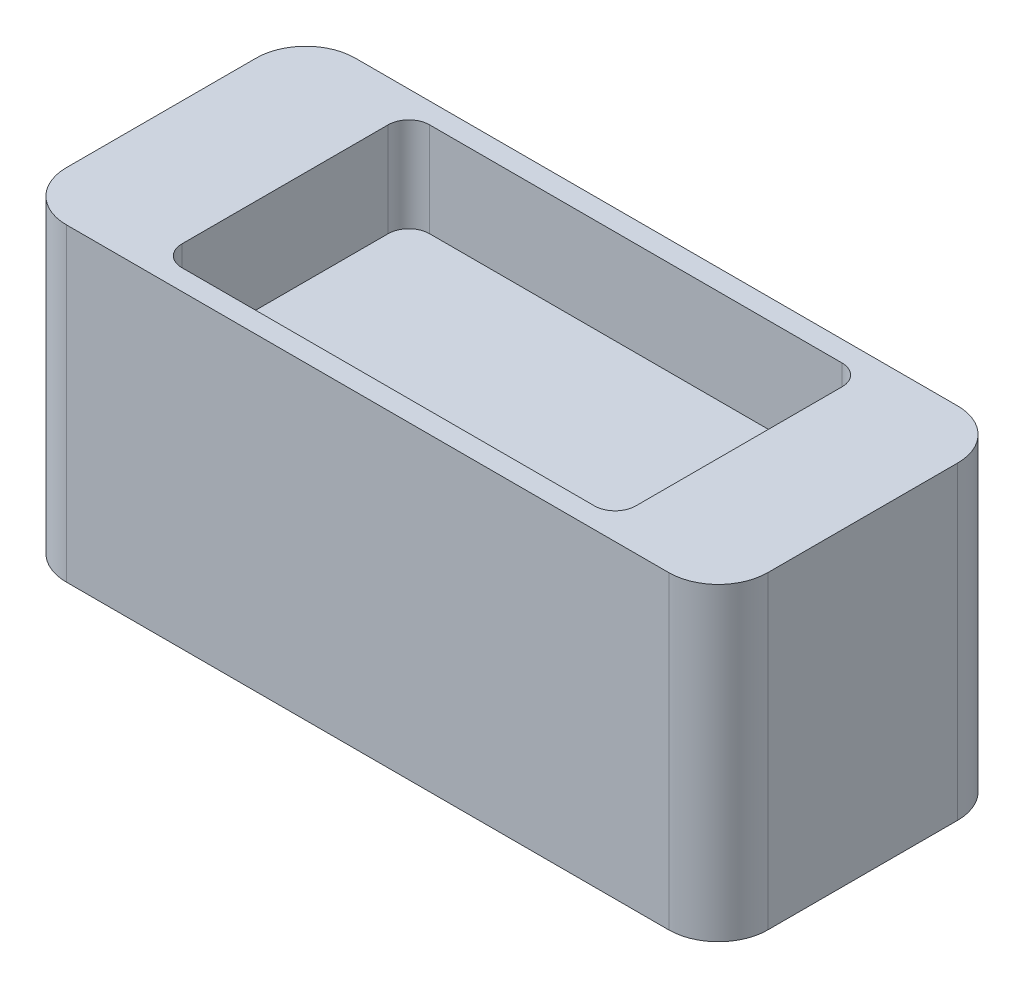
ISO-10303-21;
HEADER;
FILE_DESCRIPTION(('STEP AP214'),'2;1');
FILE_NAME('part.step','',(''),(''),'','','');
FILE_SCHEMA(('AUTOMOTIVE_DESIGN { 1 0 10303 214 1 1 1 1 }'));
ENDSEC;
DATA;
#1=APPLICATION_CONTEXT('core data for automotive mechanical design processes');
#2=APPLICATION_PROTOCOL_DEFINITION('international standard','automotive_design',2000,#1);
#3=PRODUCT_CONTEXT('',#1,'mechanical');
#4=PRODUCT('Part','Part','',(#3));
#5=PRODUCT_RELATED_PRODUCT_CATEGORY('part','',(#4));
#6=PRODUCT_DEFINITION_FORMATION('','',#4);
#7=PRODUCT_DEFINITION_CONTEXT('part definition',#1,'design');
#8=PRODUCT_DEFINITION('design','',#6,#7);
#9=PRODUCT_DEFINITION_SHAPE('','',#8);
#10=(LENGTH_UNIT() NAMED_UNIT(*) SI_UNIT(.MILLI.,.METRE.));
#11=(NAMED_UNIT(*) PLANE_ANGLE_UNIT() SI_UNIT($,.RADIAN.));
#12=(NAMED_UNIT(*) SI_UNIT($,.STERADIAN.) SOLID_ANGLE_UNIT());
#13=UNCERTAINTY_MEASURE_WITH_UNIT(LENGTH_MEASURE(1.E-05),#10,'distance_accuracy_value','');
#14=(GEOMETRIC_REPRESENTATION_CONTEXT(3) GLOBAL_UNCERTAINTY_ASSIGNED_CONTEXT((#13)) GLOBAL_UNIT_ASSIGNED_CONTEXT((#10,
#11,#12)) REPRESENTATION_CONTEXT('',''));
#15=CARTESIAN_POINT('',(0.,0.,0.));
#16=DIRECTION('',(0.,0.,1.));
#17=DIRECTION('',(1.,0.,0.));
#18=AXIS2_PLACEMENT_3D('',#15,#16,#17);
#19=CARTESIAN_POINT('',(0.,0.,0.));
#20=DIRECTION('',(0.,1.,0.));
#21=DIRECTION('',(0.,0.,1.));
#22=AXIS2_PLACEMENT_3D('',#19,#20,#21);
#23=PLANE('',#22);
#24=DIRECTION('',(1.,0.,0.));
#25=VECTOR('',#24,1.);
#26=CARTESIAN_POINT('',(0.,0.,-350.));
#27=LINE('',#26,#25);
#28=CARTESIAN_POINT('',(-730.,0.,-350.));
#29=VERTEX_POINT('',#28);
#30=CARTESIAN_POINT('',(730.,0.,-350.));
#31=VERTEX_POINT('',#30);
#32=EDGE_CURVE('E254',#29,#31,#27,.T.);
#33=ORIENTED_EDGE('',*,*,#32,.F.);
#34=CARTESIAN_POINT('',(-730.,0.,-230.));
#35=DIRECTION('',(0.,1.,0.));
#36=DIRECTION('',(0.,0.,1.));
#37=AXIS2_PLACEMENT_3D('',#34,#35,#36);
#38=CIRCLE('',#37,120.);
#39=CARTESIAN_POINT('',(-850.,0.,-230.));
#40=VERTEX_POINT('',#39);
#41=EDGE_CURVE('E208',#29,#40,#38,.T.);
#42=ORIENTED_EDGE('',*,*,#41,.T.);
#43=DIRECTION('',(0.,0.,1.));
#44=VECTOR('',#43,1.);
#45=CARTESIAN_POINT('',(-850.,0.,0.));
#46=LINE('',#45,#44);
#47=CARTESIAN_POINT('',(-850.,0.,230.));
#48=VERTEX_POINT('',#47);
#49=EDGE_CURVE('E260',#40,#48,#46,.T.);
#50=ORIENTED_EDGE('',*,*,#49,.T.);
#51=CARTESIAN_POINT('',(-730.,0.,230.));
#52=DIRECTION('',(0.,1.,0.));
#53=DIRECTION('',(0.,0.,1.));
#54=AXIS2_PLACEMENT_3D('',#51,#52,#53);
#55=CIRCLE('',#54,120.);
#56=CARTESIAN_POINT('',(-730.,0.,350.));
#57=VERTEX_POINT('',#56);
#58=EDGE_CURVE('E264',#48,#57,#55,.T.);
#59=ORIENTED_EDGE('',*,*,#58,.T.);
#60=DIRECTION('',(1.,0.,0.));
#61=VECTOR('',#60,1.);
#62=CARTESIAN_POINT('',(0.,0.,350.));
#63=LINE('',#62,#61);
#64=CARTESIAN_POINT('',(730.,0.,350.));
#65=VERTEX_POINT('',#64);
#66=EDGE_CURVE('E268',#57,#65,#63,.T.);
#67=ORIENTED_EDGE('',*,*,#66,.T.);
#68=CARTESIAN_POINT('',(730.,0.,230.));
#69=DIRECTION('',(0.,1.,0.));
#70=DIRECTION('',(0.,0.,1.));
#71=AXIS2_PLACEMENT_3D('',#68,#69,#70);
#72=CIRCLE('',#71,120.);
#73=CARTESIAN_POINT('',(850.,0.,230.));
#74=VERTEX_POINT('',#73);
#75=EDGE_CURVE('E272',#65,#74,#72,.T.);
#76=ORIENTED_EDGE('',*,*,#75,.T.);
#77=DIRECTION('',(0.,0.,1.));
#78=VECTOR('',#77,1.);
#79=CARTESIAN_POINT('',(850.,0.,0.));
#80=LINE('',#79,#78);
#81=CARTESIAN_POINT('',(850.,0.,-230.));
#82=VERTEX_POINT('',#81);
#83=EDGE_CURVE('E276',#82,#74,#80,.T.);
#84=ORIENTED_EDGE('',*,*,#83,.F.);
#85=CARTESIAN_POINT('',(730.,0.,-230.));
#86=DIRECTION('',(0.,1.,0.));
#87=DIRECTION('',(0.,0.,1.));
#88=AXIS2_PLACEMENT_3D('',#85,#86,#87);
#89=CIRCLE('',#88,120.);
#90=EDGE_CURVE('E224',#31,#82,#89,.F.);
#91=ORIENTED_EDGE('',*,*,#90,.F.);
#92=EDGE_LOOP('',(#33,#42,#50,#59,#67,#76,#84,#91));
#93=FACE_BOUND('',#92,.T.);
#94=DIRECTION('',(0.,0.,1.));
#95=VECTOR('',#94,1.);
#96=CARTESIAN_POINT('',(-550.,0.,1.01770443923973E-13));
#97=LINE('',#96,#95);
#98=CARTESIAN_POINT('',(-550.,0.,-249.999999924));
#99=VERTEX_POINT('',#98);
#100=CARTESIAN_POINT('',(-550.,0.,249.999999924));
#101=VERTEX_POINT('',#100);
#102=EDGE_CURVE('E385',#99,#101,#97,.T.);
#103=ORIENTED_EDGE('',*,*,#102,.F.);
#104=CARTESIAN_POINT('',(-499.999999924,0.,-249.999999924));
#105=DIRECTION('',(0.,1.,0.));
#106=DIRECTION('',(0.,0.,1.));
#107=AXIS2_PLACEMENT_3D('',#104,#105,#106);
#108=CIRCLE('',#107,50.000000076);
#109=CARTESIAN_POINT('',(-499.999999924,0.,-300.));
#110=VERTEX_POINT('',#109);
#111=EDGE_CURVE('E12',#99,#110,#108,.F.);
#112=ORIENTED_EDGE('',*,*,#111,.T.);
#113=DIRECTION('',(1.,0.,0.));
#114=VECTOR('',#113,1.);
#115=CARTESIAN_POINT('',(0.,0.,-300.));
#116=LINE('',#115,#114);
#117=CARTESIAN_POINT('',(499.999999924,0.,-300.));
#118=VERTEX_POINT('',#117);
#119=EDGE_CURVE('E350',#110,#118,#116,.T.);
#120=ORIENTED_EDGE('',*,*,#119,.T.);
#121=CARTESIAN_POINT('',(499.999999924,0.,-249.999999924));
#122=DIRECTION('',(0.,1.,0.));
#123=DIRECTION('',(0.,0.,1.));
#124=AXIS2_PLACEMENT_3D('',#121,#122,#123);
#125=CIRCLE('',#124,50.000000076);
#126=CARTESIAN_POINT('',(550.,0.,-249.999999924));
#127=VERTEX_POINT('',#126);
#128=EDGE_CURVE('E98',#118,#127,#125,.F.);
#129=ORIENTED_EDGE('',*,*,#128,.T.);
#130=DIRECTION('',(0.,0.,1.));
#131=VECTOR('',#130,1.);
#132=CARTESIAN_POINT('',(550.,0.,-1.01770443923973E-13));
#133=LINE('',#132,#131);
#134=CARTESIAN_POINT('',(550.,0.,249.999999924));
#135=VERTEX_POINT('',#134);
#136=EDGE_CURVE('E349',#127,#135,#133,.T.);
#137=ORIENTED_EDGE('',*,*,#136,.T.);
#138=CARTESIAN_POINT('',(499.999999924,0.,249.999999924));
#139=DIRECTION('',(0.,1.,0.));
#140=DIRECTION('',(0.,0.,1.));
#141=AXIS2_PLACEMENT_3D('',#138,#139,#140);
#142=CIRCLE('',#141,50.000000076);
#143=CARTESIAN_POINT('',(499.999999924,0.,300.));
#144=VERTEX_POINT('',#143);
#145=EDGE_CURVE('E341',#135,#144,#142,.F.);
#146=ORIENTED_EDGE('',*,*,#145,.T.);
#147=DIRECTION('',(1.,0.,0.));
#148=VECTOR('',#147,1.);
#149=CARTESIAN_POINT('',(0.,0.,300.));
#150=LINE('',#149,#148);
#151=CARTESIAN_POINT('',(-499.999999924,0.,300.));
#152=VERTEX_POINT('',#151);
#153=EDGE_CURVE('E378',#152,#144,#150,.T.);
#154=ORIENTED_EDGE('',*,*,#153,.F.);
#155=CARTESIAN_POINT('',(-499.999999924,0.,249.999999924));
#156=DIRECTION('',(0.,1.,0.));
#157=DIRECTION('',(0.,0.,1.));
#158=AXIS2_PLACEMENT_3D('',#155,#156,#157);
#159=CIRCLE('',#158,50.000000076);
#160=EDGE_CURVE('E344',#152,#101,#159,.F.);
#161=ORIENTED_EDGE('',*,*,#160,.T.);
#162=EDGE_LOOP('',(#103,#112,#120,#129,#137,#146,#154,#161));
#163=FACE_BOUND('',#162,.T.);
#164=ADVANCED_FACE('F89',(#93,#163),#23,.T.);
#165=CARTESIAN_POINT('',(-730.,-750.,230.));
#166=DIRECTION('',(0.,1.,0.));
#167=DIRECTION('',(0.,0.,1.));
#168=AXIS2_PLACEMENT_3D('',#165,#166,#167);
#169=CYLINDRICAL_SURFACE('',#168,120.);
#170=ORIENTED_EDGE('',*,*,#58,.F.);
#171=DIRECTION('',(0.,1.,0.));
#172=VECTOR('',#171,1.);
#173=CARTESIAN_POINT('',(-850.,-750.,230.));
#174=LINE('',#173,#172);
#175=CARTESIAN_POINT('',(-850.,-750.,230.));
#176=VERTEX_POINT('',#175);
#177=EDGE_CURVE('E298',#176,#48,#174,.T.);
#178=ORIENTED_EDGE('',*,*,#177,.F.);
#179=CARTESIAN_POINT('',(-730.,-750.,230.));
#180=DIRECTION('',(0.,1.,0.));
#181=DIRECTION('',(0.,0.,1.));
#182=AXIS2_PLACEMENT_3D('',#179,#180,#181);
#183=CIRCLE('',#182,120.);
#184=CARTESIAN_POINT('',(-730.,-750.,350.));
#185=VERTEX_POINT('',#184);
#186=EDGE_CURVE('E234',#176,#185,#183,.T.);
#187=ORIENTED_EDGE('',*,*,#186,.T.);
#188=DIRECTION('',(0.,1.,0.));
#189=VECTOR('',#188,1.);
#190=CARTESIAN_POINT('',(-730.,-750.,350.));
#191=LINE('',#190,#189);
#192=EDGE_CURVE('E295',#185,#57,#191,.T.);
#193=ORIENTED_EDGE('',*,*,#192,.T.);
#194=EDGE_LOOP('',(#170,#178,#187,#193));
#195=FACE_BOUND('',#194,.T.);
#196=ADVANCED_FACE('F413',(#195),#169,.T.);
#197=CARTESIAN_POINT('',(0.,-750.,350.));
#198=DIRECTION('',(0.,0.,1.));
#199=DIRECTION('',(1.,0.,0.));
#200=AXIS2_PLACEMENT_3D('',#197,#198,#199);
#201=PLANE('',#200);
#202=ORIENTED_EDGE('',*,*,#66,.F.);
#203=ORIENTED_EDGE('',*,*,#192,.F.);
#204=DIRECTION('',(1.,0.,0.));
#205=VECTOR('',#204,1.);
#206=CARTESIAN_POINT('',(0.,-750.,350.));
#207=LINE('',#206,#205);
#208=CARTESIAN_POINT('',(730.,-750.,350.));
#209=VERTEX_POINT('',#208);
#210=EDGE_CURVE('E241',#185,#209,#207,.T.);
#211=ORIENTED_EDGE('',*,*,#210,.T.);
#212=DIRECTION('',(0.,1.,0.));
#213=VECTOR('',#212,1.);
#214=CARTESIAN_POINT('',(730.,-750.,350.));
#215=LINE('',#214,#213);
#216=EDGE_CURVE('E292',#209,#65,#215,.T.);
#217=ORIENTED_EDGE('',*,*,#216,.T.);
#218=EDGE_LOOP('',(#202,#203,#211,#217));
#219=FACE_BOUND('',#218,.T.);
#220=ADVANCED_FACE('F419',(#219),#201,.T.);
#221=CARTESIAN_POINT('',(730.,-750.,230.));
#222=DIRECTION('',(0.,1.,0.));
#223=DIRECTION('',(0.,0.,1.));
#224=AXIS2_PLACEMENT_3D('',#221,#222,#223);
#225=CYLINDRICAL_SURFACE('',#224,120.);
#226=ORIENTED_EDGE('',*,*,#75,.F.);
#227=ORIENTED_EDGE('',*,*,#216,.F.);
#228=CARTESIAN_POINT('',(730.,-750.,230.));
#229=DIRECTION('',(0.,1.,0.));
#230=DIRECTION('',(0.,0.,1.));
#231=AXIS2_PLACEMENT_3D('',#228,#229,#230);
#232=CIRCLE('',#231,120.);
#233=CARTESIAN_POINT('',(850.,-750.,230.));
#234=VERTEX_POINT('',#233);
#235=EDGE_CURVE('E245',#209,#234,#232,.T.);
#236=ORIENTED_EDGE('',*,*,#235,.T.);
#237=DIRECTION('',(0.,1.,0.));
#238=VECTOR('',#237,1.);
#239=CARTESIAN_POINT('',(850.,-750.,230.));
#240=LINE('',#239,#238);
#241=EDGE_CURVE('E289',#234,#74,#240,.T.);
#242=ORIENTED_EDGE('',*,*,#241,.T.);
#243=EDGE_LOOP('',(#226,#227,#236,#242));
#244=FACE_BOUND('',#243,.T.);
#245=ADVANCED_FACE('F432',(#244),#225,.T.);
#246=CARTESIAN_POINT('',(850.,-750.,0.));
#247=DIRECTION('',(-1.,0.,0.));
#248=DIRECTION('',(0.,0.,1.));
#249=AXIS2_PLACEMENT_3D('',#246,#247,#248);
#250=PLANE('',#249);
#251=ORIENTED_EDGE('',*,*,#83,.T.);
#252=ORIENTED_EDGE('',*,*,#241,.F.);
#253=DIRECTION('',(0.,0.,1.));
#254=VECTOR('',#253,1.);
#255=CARTESIAN_POINT('',(850.,-750.,0.));
#256=LINE('',#255,#254);
#257=CARTESIAN_POINT('',(850.,-750.,-230.));
#258=VERTEX_POINT('',#257);
#259=EDGE_CURVE('E249',#258,#234,#256,.T.);
#260=ORIENTED_EDGE('',*,*,#259,.F.);
#261=DIRECTION('',(0.,1.,0.));
#262=VECTOR('',#261,1.);
#263=CARTESIAN_POINT('',(850.,-750.,-230.));
#264=LINE('',#263,#262);
#265=EDGE_CURVE('E285',#258,#82,#264,.T.);
#266=ORIENTED_EDGE('',*,*,#265,.T.);
#267=EDGE_LOOP('',(#251,#252,#260,#266));
#268=FACE_BOUND('',#267,.T.);
#269=ADVANCED_FACE('F428',(#268),#250,.F.);
#270=CARTESIAN_POINT('',(730.,-750.,-230.));
#271=DIRECTION('',(0.,1.,0.));
#272=DIRECTION('',(0.,0.,1.));
#273=AXIS2_PLACEMENT_3D('',#270,#271,#272);
#274=CYLINDRICAL_SURFACE('',#273,120.);
#275=ORIENTED_EDGE('',*,*,#90,.T.);
#276=ORIENTED_EDGE('',*,*,#265,.F.);
#277=CARTESIAN_POINT('',(730.,-750.,-230.));
#278=DIRECTION('',(0.,1.,0.));
#279=DIRECTION('',(0.,0.,1.));
#280=AXIS2_PLACEMENT_3D('',#277,#278,#279);
#281=CIRCLE('',#280,120.);
#282=CARTESIAN_POINT('',(730.,-750.,-350.));
#283=VERTEX_POINT('',#282);
#284=EDGE_CURVE('E214',#283,#258,#281,.F.);
#285=ORIENTED_EDGE('',*,*,#284,.F.);
#286=DIRECTION('',(0.,1.,0.));
#287=VECTOR('',#286,1.);
#288=CARTESIAN_POINT('',(730.,-750.,-350.));
#289=LINE('',#288,#287);
#290=EDGE_CURVE('E221',#283,#31,#289,.T.);
#291=ORIENTED_EDGE('',*,*,#290,.T.);
#292=EDGE_LOOP('',(#275,#276,#285,#291));
#293=FACE_BOUND('',#292,.T.);
#294=ADVANCED_FACE('F425',(#293),#274,.T.);
#295=CARTESIAN_POINT('',(0.,-750.,-350.));
#296=DIRECTION('',(0.,0.,1.));
#297=DIRECTION('',(1.,0.,0.));
#298=AXIS2_PLACEMENT_3D('',#295,#296,#297);
#299=PLANE('',#298);
#300=ORIENTED_EDGE('',*,*,#32,.T.);
#301=ORIENTED_EDGE('',*,*,#290,.F.);
#302=DIRECTION('',(1.,0.,0.));
#303=VECTOR('',#302,1.);
#304=CARTESIAN_POINT('',(0.,-750.,-350.));
#305=LINE('',#304,#303);
#306=CARTESIAN_POINT('',(-730.,-750.,-350.));
#307=VERTEX_POINT('',#306);
#308=EDGE_CURVE('E218',#307,#283,#305,.T.);
#309=ORIENTED_EDGE('',*,*,#308,.F.);
#310=DIRECTION('',(0.,1.,0.));
#311=VECTOR('',#310,1.);
#312=CARTESIAN_POINT('',(-730.,-750.,-350.));
#313=LINE('',#312,#311);
#314=EDGE_CURVE('E202',#307,#29,#313,.T.);
#315=ORIENTED_EDGE('',*,*,#314,.T.);
#316=EDGE_LOOP('',(#300,#301,#309,#315));
#317=FACE_BOUND('',#316,.T.);
#318=ADVANCED_FACE('F219',(#317),#299,.F.);
#319=CARTESIAN_POINT('',(-730.,-750.,-230.));
#320=DIRECTION('',(0.,1.,0.));
#321=DIRECTION('',(0.,0.,1.));
#322=AXIS2_PLACEMENT_3D('',#319,#320,#321);
#323=CYLINDRICAL_SURFACE('',#322,120.);
#324=ORIENTED_EDGE('',*,*,#41,.F.);
#325=ORIENTED_EDGE('',*,*,#314,.F.);
#326=CARTESIAN_POINT('',(-730.,-750.,-230.));
#327=DIRECTION('',(0.,1.,0.));
#328=DIRECTION('',(0.,0.,1.));
#329=AXIS2_PLACEMENT_3D('',#326,#327,#328);
#330=CIRCLE('',#329,120.);
#331=CARTESIAN_POINT('',(-850.,-750.,-230.));
#332=VERTEX_POINT('',#331);
#333=EDGE_CURVE('E206',#307,#332,#330,.T.);
#334=ORIENTED_EDGE('',*,*,#333,.T.);
#335=DIRECTION('',(0.,1.,0.));
#336=VECTOR('',#335,1.);
#337=CARTESIAN_POINT('',(-850.,-750.,-230.));
#338=LINE('',#337,#336);
#339=EDGE_CURVE('E213',#332,#40,#338,.T.);
#340=ORIENTED_EDGE('',*,*,#339,.T.);
#341=EDGE_LOOP('',(#324,#325,#334,#340));
#342=FACE_BOUND('',#341,.T.);
#343=ADVANCED_FACE('F204',(#342),#323,.T.);
#344=CARTESIAN_POINT('',(-850.,-750.,0.));
#345=DIRECTION('',(-1.,0.,0.));
#346=DIRECTION('',(0.,0.,1.));
#347=AXIS2_PLACEMENT_3D('',#344,#345,#346);
#348=PLANE('',#347);
#349=ORIENTED_EDGE('',*,*,#49,.F.);
#350=ORIENTED_EDGE('',*,*,#339,.F.);
#351=DIRECTION('',(0.,0.,1.));
#352=VECTOR('',#351,1.);
#353=CARTESIAN_POINT('',(-850.,-750.,0.));
#354=LINE('',#353,#352);
#355=EDGE_CURVE('E230',#332,#176,#354,.T.);
#356=ORIENTED_EDGE('',*,*,#355,.T.);
#357=ORIENTED_EDGE('',*,*,#177,.T.);
#358=EDGE_LOOP('',(#349,#350,#356,#357));
#359=FACE_BOUND('',#358,.T.);
#360=ADVANCED_FACE('F440',(#359),#348,.T.);
#361=CARTESIAN_POINT('',(0.,-750.,0.));
#362=DIRECTION('',(0.,1.,0.));
#363=DIRECTION('',(0.,0.,1.));
#364=AXIS2_PLACEMENT_3D('',#361,#362,#363);
#365=PLANE('',#364);
#366=ORIENTED_EDGE('',*,*,#308,.T.);
#367=ORIENTED_EDGE('',*,*,#284,.T.);
#368=ORIENTED_EDGE('',*,*,#259,.T.);
#369=ORIENTED_EDGE('',*,*,#235,.F.);
#370=ORIENTED_EDGE('',*,*,#210,.F.);
#371=ORIENTED_EDGE('',*,*,#186,.F.);
#372=ORIENTED_EDGE('',*,*,#355,.F.);
#373=ORIENTED_EDGE('',*,*,#333,.F.);
#374=EDGE_LOOP('',(#366,#367,#368,#369,#370,#371,#372,#373));
#375=FACE_BOUND('',#374,.T.);
#376=ADVANCED_FACE('F227',(#375),#365,.F.);
#377=CARTESIAN_POINT('',(550.,-228.6,-1.01770443923973E-13));
#378=DIRECTION('',(-1.,0.,0.));
#379=DIRECTION('',(0.,0.,1.));
#380=AXIS2_PLACEMENT_3D('',#377,#378,#379);
#381=PLANE('',#380);
#382=DIRECTION('',(0.,0.,1.));
#383=VECTOR('',#382,1.);
#384=CARTESIAN_POINT('',(550.,-228.6,-1.01770443923973E-13));
#385=LINE('',#384,#383);
#386=CARTESIAN_POINT('',(550.,-228.6,-249.999999924));
#387=VERTEX_POINT('',#386);
#388=CARTESIAN_POINT('',(550.,-228.6,249.999999924));
#389=VERTEX_POINT('',#388);
#390=EDGE_CURVE('E367',#387,#389,#385,.T.);
#391=ORIENTED_EDGE('',*,*,#390,.T.);
#392=DIRECTION('',(0.,1.,0.));
#393=VECTOR('',#392,1.);
#394=CARTESIAN_POINT('',(550.,-228.6,249.999999924));
#395=LINE('',#394,#393);
#396=EDGE_CURVE('E305',#389,#135,#395,.T.);
#397=ORIENTED_EDGE('',*,*,#396,.T.);
#398=ORIENTED_EDGE('',*,*,#136,.F.);
#399=DIRECTION('',(0.,1.,0.));
#400=VECTOR('',#399,1.);
#401=CARTESIAN_POINT('',(550.,-228.6,-249.999999924));
#402=LINE('',#401,#400);
#403=EDGE_CURVE('E284',#127,#387,#402,.F.);
#404=ORIENTED_EDGE('',*,*,#403,.T.);
#405=EDGE_LOOP('',(#391,#397,#398,#404));
#406=FACE_BOUND('',#405,.T.);
#407=ADVANCED_FACE('F353',(#406),#381,.T.);
#408=CARTESIAN_POINT('',(0.,-228.6,300.));
#409=DIRECTION('',(0.,0.,1.));
#410=DIRECTION('',(1.,0.,0.));
#411=AXIS2_PLACEMENT_3D('',#408,#409,#410);
#412=PLANE('',#411);
#413=ORIENTED_EDGE('',*,*,#153,.T.);
#414=DIRECTION('',(0.,1.,0.));
#415=VECTOR('',#414,1.);
#416=CARTESIAN_POINT('',(499.999999924,-228.6,300.));
#417=LINE('',#416,#415);
#418=CARTESIAN_POINT('',(499.999999924,-228.6,300.));
#419=VERTEX_POINT('',#418);
#420=EDGE_CURVE('E313',#144,#419,#417,.F.);
#421=ORIENTED_EDGE('',*,*,#420,.T.);
#422=DIRECTION('',(1.,0.,0.));
#423=VECTOR('',#422,1.);
#424=CARTESIAN_POINT('',(0.,-228.6,300.));
#425=LINE('',#424,#423);
#426=CARTESIAN_POINT('',(-499.999999924,-228.6,300.));
#427=VERTEX_POINT('',#426);
#428=EDGE_CURVE('E257',#427,#419,#425,.T.);
#429=ORIENTED_EDGE('',*,*,#428,.F.);
#430=DIRECTION('',(0.,1.,0.));
#431=VECTOR('',#430,1.);
#432=CARTESIAN_POINT('',(-499.999999924,0.,300.));
#433=LINE('',#432,#431);
#434=EDGE_CURVE('E309',#427,#152,#433,.T.);
#435=ORIENTED_EDGE('',*,*,#434,.T.);
#436=EDGE_LOOP('',(#413,#421,#429,#435));
#437=FACE_BOUND('',#436,.T.);
#438=ADVANCED_FACE('F393',(#437),#412,.F.);
#439=CARTESIAN_POINT('',(-550.,-228.6,1.01770443923973E-13));
#440=DIRECTION('',(-1.,0.,0.));
#441=DIRECTION('',(0.,0.,1.));
#442=AXIS2_PLACEMENT_3D('',#439,#440,#441);
#443=PLANE('',#442);
#444=ORIENTED_EDGE('',*,*,#102,.T.);
#445=DIRECTION('',(0.,1.,0.));
#446=VECTOR('',#445,1.);
#447=CARTESIAN_POINT('',(-550.,-228.6,249.999999924));
#448=LINE('',#447,#446);
#449=CARTESIAN_POINT('',(-550.,-228.6,249.999999924));
#450=VERTEX_POINT('',#449);
#451=EDGE_CURVE('E332',#101,#450,#448,.F.);
#452=ORIENTED_EDGE('',*,*,#451,.T.);
#453=DIRECTION('',(0.,0.,1.));
#454=VECTOR('',#453,1.);
#455=CARTESIAN_POINT('',(-550.,-228.6,1.01770443923973E-13));
#456=LINE('',#455,#454);
#457=CARTESIAN_POINT('',(-550.,-228.6,-249.999999924));
#458=VERTEX_POINT('',#457);
#459=EDGE_CURVE('E372',#458,#450,#456,.T.);
#460=ORIENTED_EDGE('',*,*,#459,.F.);
#461=DIRECTION('',(0.,1.,0.));
#462=VECTOR('',#461,1.);
#463=CARTESIAN_POINT('',(-550.,-228.6,-249.999999924));
#464=LINE('',#463,#462);
#465=EDGE_CURVE('E328',#458,#99,#464,.T.);
#466=ORIENTED_EDGE('',*,*,#465,.T.);
#467=EDGE_LOOP('',(#444,#452,#460,#466));
#468=FACE_BOUND('',#467,.T.);
#469=ADVANCED_FACE('F404',(#468),#443,.F.);
#470=CARTESIAN_POINT('',(0.,-228.6,-300.));
#471=DIRECTION('',(0.,0.,1.));
#472=DIRECTION('',(1.,0.,0.));
#473=AXIS2_PLACEMENT_3D('',#470,#471,#472);
#474=PLANE('',#473);
#475=DIRECTION('',(1.,0.,0.));
#476=VECTOR('',#475,1.);
#477=CARTESIAN_POINT('',(0.,-228.6,-300.));
#478=LINE('',#477,#476);
#479=CARTESIAN_POINT('',(-499.999999924,-228.6,-300.));
#480=VERTEX_POINT('',#479);
#481=CARTESIAN_POINT('',(499.999999924,-228.6,-300.));
#482=VERTEX_POINT('',#481);
#483=EDGE_CURVE('E365',#480,#482,#478,.T.);
#484=ORIENTED_EDGE('',*,*,#483,.T.);
#485=DIRECTION('',(0.,1.,0.));
#486=VECTOR('',#485,1.);
#487=CARTESIAN_POINT('',(499.999999924,0.,-300.));
#488=LINE('',#487,#486);
#489=EDGE_CURVE('E338',#482,#118,#488,.T.);
#490=ORIENTED_EDGE('',*,*,#489,.T.);
#491=ORIENTED_EDGE('',*,*,#119,.F.);
#492=DIRECTION('',(0.,1.,0.));
#493=VECTOR('',#492,1.);
#494=CARTESIAN_POINT('',(-499.999999924,-228.6,-300.));
#495=LINE('',#494,#493);
#496=EDGE_CURVE('E335',#110,#480,#495,.F.);
#497=ORIENTED_EDGE('',*,*,#496,.T.);
#498=EDGE_LOOP('',(#484,#490,#491,#497));
#499=FACE_BOUND('',#498,.T.);
#500=ADVANCED_FACE('F369',(#499),#474,.T.);
#501=CARTESIAN_POINT('',(0.,-228.6,0.));
#502=DIRECTION('',(0.,1.,0.));
#503=DIRECTION('',(0.,0.,1.));
#504=AXIS2_PLACEMENT_3D('',#501,#502,#503);
#505=PLANE('',#504);
#506=ORIENTED_EDGE('',*,*,#428,.T.);
#507=CARTESIAN_POINT('',(499.999999924,-228.6,249.999999924));
#508=DIRECTION('',(0.,1.,0.));
#509=DIRECTION('',(0.,0.,1.));
#510=AXIS2_PLACEMENT_3D('',#507,#508,#509);
#511=CIRCLE('',#510,50.000000076);
#512=EDGE_CURVE('E325',#419,#389,#511,.T.);
#513=ORIENTED_EDGE('',*,*,#512,.T.);
#514=ORIENTED_EDGE('',*,*,#390,.F.);
#515=CARTESIAN_POINT('',(499.999999924,-228.6,-249.999999924));
#516=DIRECTION('',(0.,1.,0.));
#517=DIRECTION('',(0.,0.,1.));
#518=AXIS2_PLACEMENT_3D('',#515,#516,#517);
#519=CIRCLE('',#518,50.000000076);
#520=EDGE_CURVE('E319',#387,#482,#519,.T.);
#521=ORIENTED_EDGE('',*,*,#520,.T.);
#522=ORIENTED_EDGE('',*,*,#483,.F.);
#523=CARTESIAN_POINT('',(-499.999999924,-228.6,-249.999999924));
#524=DIRECTION('',(0.,1.,0.));
#525=DIRECTION('',(0.,0.,1.));
#526=AXIS2_PLACEMENT_3D('',#523,#524,#525);
#527=CIRCLE('',#526,50.000000076);
#528=EDGE_CURVE('E316',#480,#458,#527,.T.);
#529=ORIENTED_EDGE('',*,*,#528,.T.);
#530=ORIENTED_EDGE('',*,*,#459,.T.);
#531=CARTESIAN_POINT('',(-499.999999924,-228.6,249.999999924));
#532=DIRECTION('',(0.,1.,0.));
#533=DIRECTION('',(0.,0.,1.));
#534=AXIS2_PLACEMENT_3D('',#531,#532,#533);
#535=CIRCLE('',#534,50.000000076);
#536=EDGE_CURVE('E322',#450,#427,#535,.T.);
#537=ORIENTED_EDGE('',*,*,#536,.T.);
#538=EDGE_LOOP('',(#506,#513,#514,#521,#522,#529,#530,#537));
#539=FACE_BOUND('',#538,.T.);
#540=ADVANCED_FACE('F364',(#539),#505,.T.);
#541=CARTESIAN_POINT('',(499.999999924,-228.6,249.999999924));
#542=DIRECTION('',(0.,1.,0.));
#543=DIRECTION('',(0.,0.,1.));
#544=AXIS2_PLACEMENT_3D('',#541,#542,#543);
#545=CYLINDRICAL_SURFACE('',#544,50.000000076);
#546=ORIENTED_EDGE('',*,*,#512,.F.);
#547=ORIENTED_EDGE('',*,*,#420,.F.);
#548=ORIENTED_EDGE('',*,*,#145,.F.);
#549=ORIENTED_EDGE('',*,*,#396,.F.);
#550=EDGE_LOOP('',(#546,#547,#548,#549));
#551=FACE_BOUND('',#550,.T.);
#552=ADVANCED_FACE('F398',(#551),#545,.F.);
#553=CARTESIAN_POINT('',(-499.999999924,-228.6,249.999999924));
#554=DIRECTION('',(0.,-1.,0.));
#555=DIRECTION('',(0.,0.,-1.));
#556=AXIS2_PLACEMENT_3D('',#553,#554,#555);
#557=CYLINDRICAL_SURFACE('',#556,50.000000076);
#558=ORIENTED_EDGE('',*,*,#536,.F.);
#559=ORIENTED_EDGE('',*,*,#451,.F.);
#560=ORIENTED_EDGE('',*,*,#160,.F.);
#561=ORIENTED_EDGE('',*,*,#434,.F.);
#562=EDGE_LOOP('',(#558,#559,#560,#561));
#563=FACE_BOUND('',#562,.T.);
#564=ADVANCED_FACE('F401',(#563),#557,.F.);
#565=CARTESIAN_POINT('',(499.999999924,-228.6,-249.999999924));
#566=DIRECTION('',(0.,-1.,0.));
#567=DIRECTION('',(0.,0.,-1.));
#568=AXIS2_PLACEMENT_3D('',#565,#566,#567);
#569=CYLINDRICAL_SURFACE('',#568,50.000000076);
#570=ORIENTED_EDGE('',*,*,#520,.F.);
#571=ORIENTED_EDGE('',*,*,#403,.F.);
#572=ORIENTED_EDGE('',*,*,#128,.F.);
#573=ORIENTED_EDGE('',*,*,#489,.F.);
#574=EDGE_LOOP('',(#570,#571,#572,#573));
#575=FACE_BOUND('',#574,.T.);
#576=ADVANCED_FACE('F359',(#575),#569,.F.);
#577=CARTESIAN_POINT('',(-499.999999924,-228.6,-249.999999924));
#578=DIRECTION('',(0.,1.,0.));
#579=DIRECTION('',(0.,0.,1.));
#580=AXIS2_PLACEMENT_3D('',#577,#578,#579);
#581=CYLINDRICAL_SURFACE('',#580,50.000000076);
#582=ORIENTED_EDGE('',*,*,#528,.F.);
#583=ORIENTED_EDGE('',*,*,#496,.F.);
#584=ORIENTED_EDGE('',*,*,#111,.F.);
#585=ORIENTED_EDGE('',*,*,#465,.F.);
#586=EDGE_LOOP('',(#582,#583,#584,#585));
#587=FACE_BOUND('',#586,.T.);
#588=ADVANCED_FACE('F91',(#587),#581,.F.);
#589=CLOSED_SHELL('',(#164,#196,#220,#245,#269,#294,#318,#343,#360,#376,#407,#438,#469,#500,
#540,#552,#564,#576,#588));
#590=MANIFOLD_SOLID_BREP('B2',#589);
#591=ADVANCED_BREP_SHAPE_REPRESENTATION('',(#18,#590),#14);
#592=SHAPE_DEFINITION_REPRESENTATION(#9,#591);
ENDSEC;
END-ISO-10303-21;
